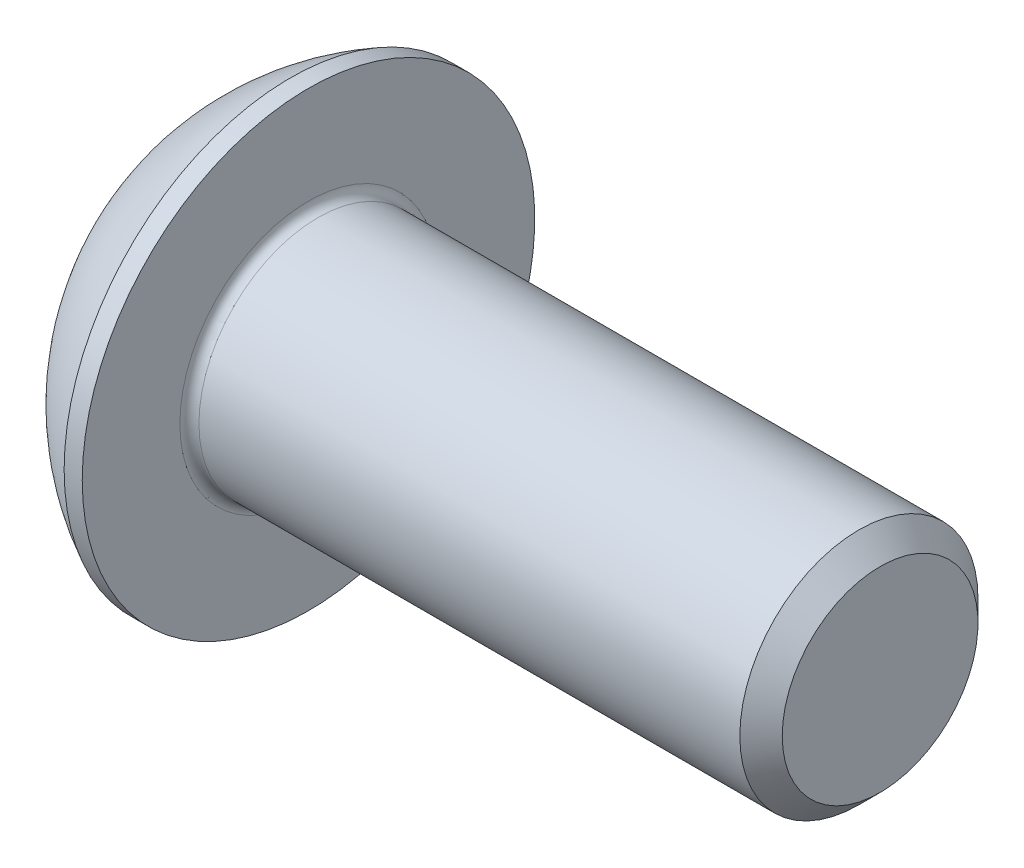
ISO-10303-21;
HEADER;
FILE_DESCRIPTION(('STEP AP214'),'2;1');
FILE_NAME('part.step','',(''),(''),'','','');
FILE_SCHEMA(('AUTOMOTIVE_DESIGN { 1 0 10303 214 1 1 1 1 }'));
ENDSEC;
DATA;
#1=APPLICATION_CONTEXT('core data for automotive mechanical design processes');
#2=APPLICATION_PROTOCOL_DEFINITION('international standard','automotive_design',2000,#1);
#3=PRODUCT_CONTEXT('',#1,'mechanical');
#4=PRODUCT('Part','Part','',(#3));
#5=PRODUCT_RELATED_PRODUCT_CATEGORY('part','',(#4));
#6=PRODUCT_DEFINITION_FORMATION('','',#4);
#7=PRODUCT_DEFINITION_CONTEXT('part definition',#1,'design');
#8=PRODUCT_DEFINITION('design','',#6,#7);
#9=PRODUCT_DEFINITION_SHAPE('','',#8);
#10=(LENGTH_UNIT() NAMED_UNIT(*) SI_UNIT(.MILLI.,.METRE.));
#11=(NAMED_UNIT(*) PLANE_ANGLE_UNIT() SI_UNIT($,.RADIAN.));
#12=(NAMED_UNIT(*) SI_UNIT($,.STERADIAN.) SOLID_ANGLE_UNIT());
#13=UNCERTAINTY_MEASURE_WITH_UNIT(LENGTH_MEASURE(1.E-05),#10,'distance_accuracy_value','');
#14=(GEOMETRIC_REPRESENTATION_CONTEXT(3) GLOBAL_UNCERTAINTY_ASSIGNED_CONTEXT((#13)) GLOBAL_UNIT_ASSIGNED_CONTEXT((#10,
#11,#12)) REPRESENTATION_CONTEXT('',''));
#15=CARTESIAN_POINT('',(0.,0.,0.));
#16=DIRECTION('',(0.,0.,1.));
#17=DIRECTION('',(1.,0.,0.));
#18=AXIS2_PLACEMENT_3D('',#15,#16,#17);
#19=CARTESIAN_POINT('',(0.,0.,0.));
#20=DIRECTION('',(-1.,0.,0.));
#21=DIRECTION('',(0.,0.,1.));
#22=AXIS2_PLACEMENT_3D('',#19,#20,#21);
#23=PLANE('',#22);
#24=CARTESIAN_POINT('',(0.,0.,0.));
#25=DIRECTION('',(-1.,0.,0.));
#26=DIRECTION('',(0.,0.,1.));
#27=AXIS2_PLACEMENT_3D('',#24,#25,#26);
#28=CIRCLE('',#27,2.375);
#29=CARTESIAN_POINT('',(0.,0.,2.375));
#30=VERTEX_POINT('',#29);
#31=EDGE_CURVE('E157',#30,#30,#28,.T.);
#32=ORIENTED_EDGE('',*,*,#31,.T.);
#33=EDGE_LOOP('',(#32));
#34=FACE_BOUND('',#33,.T.);
#35=DIRECTION('',(0.,-1.,0.));
#36=VECTOR('',#35,1.);
#37=CARTESIAN_POINT('',(0.,-0.866025403784438,1.5));
#38=LINE('',#37,#36);
#39=CARTESIAN_POINT('',(0.,0.866025403784439,1.5));
#40=VERTEX_POINT('',#39);
#41=CARTESIAN_POINT('',(0.,-0.866025403784438,1.5));
#42=VERTEX_POINT('',#41);
#43=EDGE_CURVE('E52',#40,#42,#38,.T.);
#44=ORIENTED_EDGE('',*,*,#43,.T.);
#45=DIRECTION('',(0.,-0.500000000000001,-0.866025403784438));
#46=VECTOR('',#45,1.);
#47=CARTESIAN_POINT('',(0.,-1.73205080756888,0.));
#48=LINE('',#47,#46);
#49=CARTESIAN_POINT('',(0.,-1.73205080756888,0.));
#50=VERTEX_POINT('',#49);
#51=EDGE_CURVE('E277',#42,#50,#48,.T.);
#52=ORIENTED_EDGE('',*,*,#51,.T.);
#53=DIRECTION('',(0.,0.500000000000001,-0.866025403784438));
#54=VECTOR('',#53,1.);
#55=CARTESIAN_POINT('',(0.,-0.866025403784438,-1.5));
#56=LINE('',#55,#54);
#57=CARTESIAN_POINT('',(0.,-0.866025403784438,-1.5));
#58=VERTEX_POINT('',#57);
#59=EDGE_CURVE('E132',#50,#58,#56,.T.);
#60=ORIENTED_EDGE('',*,*,#59,.T.);
#61=DIRECTION('',(0.,1.,0.));
#62=VECTOR('',#61,1.);
#63=CARTESIAN_POINT('',(0.,0.866025403784439,-1.5));
#64=LINE('',#63,#62);
#65=CARTESIAN_POINT('',(0.,0.866025403784439,-1.5));
#66=VERTEX_POINT('',#65);
#67=EDGE_CURVE('E280',#58,#66,#64,.T.);
#68=ORIENTED_EDGE('',*,*,#67,.T.);
#69=DIRECTION('',(0.,0.5,0.866025403784439));
#70=VECTOR('',#69,1.);
#71=CARTESIAN_POINT('',(0.,1.73205080756888,0.));
#72=LINE('',#71,#70);
#73=CARTESIAN_POINT('',(0.,1.73205080756888,0.));
#74=VERTEX_POINT('',#73);
#75=EDGE_CURVE('E282',#66,#74,#72,.T.);
#76=ORIENTED_EDGE('',*,*,#75,.T.);
#77=DIRECTION('',(0.,-0.5,0.866025403784439));
#78=VECTOR('',#77,1.);
#79=CARTESIAN_POINT('',(0.,0.866025403784439,1.5));
#80=LINE('',#79,#78);
#81=EDGE_CURVE('E284',#74,#40,#80,.T.);
#82=ORIENTED_EDGE('',*,*,#81,.T.);
#83=EDGE_LOOP('',(#44,#52,#60,#68,#76,#82));
#84=FACE_BOUND('',#83,.T.);
#85=ADVANCED_FACE('F37',(#34,#84),#23,.T.);
#86=CARTESIAN_POINT('',(4.75501582278481,0.,0.));
#87=DIRECTION('',(-1.,0.,0.));
#88=DIRECTION('',(0.,1.,0.));
#89=AXIS2_PLACEMENT_3D('',#86,#87,#88);
#90=SPHERICAL_SURFACE('',#89,5.3151482081814);
#91=CARTESIAN_POINT('',(2.37,0.,0.));
#92=DIRECTION('',(-1.,0.,0.));
#93=DIRECTION('',(0.,0.,1.));
#94=AXIS2_PLACEMENT_3D('',#91,#92,#93);
#95=CIRCLE('',#94,4.75);
#96=CARTESIAN_POINT('',(2.37,0.,4.75));
#97=VERTEX_POINT('',#96);
#98=EDGE_CURVE('E154',#97,#97,#95,.T.);
#99=ORIENTED_EDGE('',*,*,#98,.T.);
#100=EDGE_LOOP('',(#99));
#101=FACE_BOUND('',#100,.T.);
#102=ORIENTED_EDGE('',*,*,#31,.F.);
#103=EDGE_LOOP('',(#102));
#104=FACE_BOUND('',#103,.T.);
#105=ADVANCED_FACE('F178',(#101,#104),#90,.T.);
#106=CARTESIAN_POINT('',(0.,0.,0.));
#107=DIRECTION('',(-1.,0.,0.));
#108=DIRECTION('',(0.,0.,1.));
#109=AXIS2_PLACEMENT_3D('',#106,#107,#108);
#110=CYLINDRICAL_SURFACE('',#109,4.75);
#111=ORIENTED_EDGE('',*,*,#98,.F.);
#112=EDGE_LOOP('',(#111));
#113=FACE_BOUND('',#112,.T.);
#114=CARTESIAN_POINT('',(2.75,0.,0.));
#115=DIRECTION('',(-1.,0.,0.));
#116=DIRECTION('',(0.,0.,1.));
#117=AXIS2_PLACEMENT_3D('',#114,#115,#116);
#118=CIRCLE('',#117,4.75);
#119=CARTESIAN_POINT('',(2.75,0.,4.75));
#120=VERTEX_POINT('',#119);
#121=EDGE_CURVE('E151',#120,#120,#118,.T.);
#122=ORIENTED_EDGE('',*,*,#121,.T.);
#123=EDGE_LOOP('',(#122));
#124=FACE_BOUND('',#123,.T.);
#125=ADVANCED_FACE('F183',(#113,#124),#110,.T.);
#126=CARTESIAN_POINT('',(2.75,2.5,0.));
#127=DIRECTION('',(-1.,0.,0.));
#128=DIRECTION('',(0.,0.,1.));
#129=AXIS2_PLACEMENT_3D('',#126,#127,#128);
#130=PLANE('',#129);
#131=CARTESIAN_POINT('',(2.75,0.,0.));
#132=DIRECTION('',(-1.,0.,0.));
#133=DIRECTION('',(0.,0.,1.));
#134=AXIS2_PLACEMENT_3D('',#131,#132,#133);
#135=CIRCLE('',#134,2.7);
#136=CARTESIAN_POINT('',(2.75,0.,2.7));
#137=VERTEX_POINT('',#136);
#138=EDGE_CURVE('E45',#137,#137,#135,.T.);
#139=ORIENTED_EDGE('',*,*,#138,.T.);
#140=EDGE_LOOP('',(#139));
#141=FACE_BOUND('',#140,.T.);
#142=ORIENTED_EDGE('',*,*,#121,.F.);
#143=EDGE_LOOP('',(#142));
#144=FACE_BOUND('',#143,.T.);
#145=ADVANCED_FACE('F162',(#141,#144),#130,.F.);
#146=CARTESIAN_POINT('',(0.,0.,0.));
#147=DIRECTION('',(-1.,0.,0.));
#148=DIRECTION('',(0.,0.,1.));
#149=AXIS2_PLACEMENT_3D('',#146,#147,#148);
#150=CYLINDRICAL_SURFACE('',#149,2.5);
#151=CARTESIAN_POINT('',(2.95,0.,0.));
#152=DIRECTION('',(-1.,0.,0.));
#153=DIRECTION('',(0.,0.,1.));
#154=AXIS2_PLACEMENT_3D('',#151,#152,#153);
#155=CIRCLE('',#154,2.5);
#156=CARTESIAN_POINT('',(2.95,0.,2.5));
#157=VERTEX_POINT('',#156);
#158=EDGE_CURVE('E11',#157,#157,#155,.F.);
#159=ORIENTED_EDGE('',*,*,#158,.T.);
#160=EDGE_LOOP('',(#159));
#161=FACE_BOUND('',#160,.T.);
#162=CARTESIAN_POINT('',(14.305,0.,0.));
#163=DIRECTION('',(-1.,0.,0.));
#164=DIRECTION('',(0.,0.,1.));
#165=AXIS2_PLACEMENT_3D('',#162,#163,#164);
#166=CIRCLE('',#165,2.5);
#167=CARTESIAN_POINT('',(14.305,0.,2.5));
#168=VERTEX_POINT('',#167);
#169=EDGE_CURVE('E148',#168,#168,#166,.T.);
#170=ORIENTED_EDGE('',*,*,#169,.T.);
#171=EDGE_LOOP('',(#170));
#172=FACE_BOUND('',#171,.T.);
#173=ADVANCED_FACE('F192',(#161,#172),#150,.T.);
#174=CARTESIAN_POINT('',(14.75,0.,0.));
#175=DIRECTION('',(-1.,0.,0.));
#176=DIRECTION('',(0.,0.,1.));
#177=AXIS2_PLACEMENT_3D('',#174,#175,#176);
#178=CONICAL_SURFACE('',#177,2.055,0.785398163397445);
#179=ORIENTED_EDGE('',*,*,#169,.F.);
#180=EDGE_LOOP('',(#179));
#181=FACE_BOUND('',#180,.T.);
#182=CARTESIAN_POINT('',(14.75,0.,0.));
#183=DIRECTION('',(-1.,0.,0.));
#184=DIRECTION('',(0.,0.,1.));
#185=AXIS2_PLACEMENT_3D('',#182,#183,#184);
#186=CIRCLE('',#185,2.055);
#187=CARTESIAN_POINT('',(14.75,0.,2.055));
#188=VERTEX_POINT('',#187);
#189=EDGE_CURVE('E144',#188,#188,#186,.T.);
#190=ORIENTED_EDGE('',*,*,#189,.T.);
#191=EDGE_LOOP('',(#190));
#192=FACE_BOUND('',#191,.T.);
#193=ADVANCED_FACE('F173',(#181,#192),#178,.T.);
#194=CARTESIAN_POINT('',(14.75,0.,0.));
#195=DIRECTION('',(-1.,0.,0.));
#196=DIRECTION('',(0.,0.,1.));
#197=AXIS2_PLACEMENT_3D('',#194,#195,#196);
#198=PLANE('',#197);
#199=ORIENTED_EDGE('',*,*,#189,.F.);
#200=EDGE_LOOP('',(#199));
#201=FACE_BOUND('',#200,.T.);
#202=ADVANCED_FACE('F166',(#201),#198,.F.);
#203=CARTESIAN_POINT('',(2.95,0.,0.));
#204=DIRECTION('',(-1.,0.,0.));
#205=DIRECTION('',(0.,0.,1.));
#206=AXIS2_PLACEMENT_3D('',#203,#204,#205);
#207=TOROIDAL_SURFACE('',#206,2.7,0.2);
#208=ORIENTED_EDGE('',*,*,#158,.F.);
#209=EDGE_LOOP('',(#208));
#210=FACE_BOUND('',#209,.T.);
#211=ORIENTED_EDGE('',*,*,#138,.F.);
#212=EDGE_LOOP('',(#211));
#213=FACE_BOUND('',#212,.T.);
#214=ADVANCED_FACE('F39',(#210,#213),#207,.F.);
#215=CARTESIAN_POINT('',(1.56,-1.73205080756888,0.));
#216=DIRECTION('',(0.,0.866025403784438,-0.500000000000001));
#217=DIRECTION('',(0.,0.500000000000001,0.866025403784438));
#218=AXIS2_PLACEMENT_3D('',#215,#216,#217);
#219=PLANE('',#218);
#220=DIRECTION('',(0.,-0.500000000000001,-0.866025403784438));
#221=VECTOR('',#220,1.);
#222=CARTESIAN_POINT('',(1.56,-1.73205080756888,0.));
#223=LINE('',#222,#221);
#224=CARTESIAN_POINT('',(1.56,-0.866025403784438,1.5));
#225=VERTEX_POINT('',#224);
#226=CARTESIAN_POINT('',(1.56,-1.29903810567666,0.750000000000002));
#227=VERTEX_POINT('',#226);
#228=EDGE_CURVE('E118',#225,#227,#223,.T.);
#229=ORIENTED_EDGE('',*,*,#228,.T.);
#230=CARTESIAN_POINT('',(1.56,-1.73205080756888,0.));
#231=VERTEX_POINT('',#230);
#232=EDGE_CURVE('E113',#227,#231,#223,.T.);
#233=ORIENTED_EDGE('',*,*,#232,.T.);
#234=DIRECTION('',(-1.,0.,0.));
#235=VECTOR('',#234,1.);
#236=CARTESIAN_POINT('',(1.56,-1.73205080756888,0.));
#237=LINE('',#236,#235);
#238=EDGE_CURVE('E115',#231,#50,#237,.T.);
#239=ORIENTED_EDGE('',*,*,#238,.T.);
#240=ORIENTED_EDGE('',*,*,#51,.F.);
#241=DIRECTION('',(-1.,0.,0.));
#242=VECTOR('',#241,1.);
#243=CARTESIAN_POINT('',(1.56,-0.866025403784438,1.5));
#244=LINE('',#243,#242);
#245=EDGE_CURVE('E273',#225,#42,#244,.T.);
#246=ORIENTED_EDGE('',*,*,#245,.F.);
#247=EDGE_LOOP('',(#229,#233,#239,#240,#246));
#248=FACE_BOUND('',#247,.T.);
#249=ADVANCED_FACE('F114',(#248),#219,.T.);
#250=CARTESIAN_POINT('',(1.56,-0.866025403784438,-1.5));
#251=DIRECTION('',(0.,0.866025403784438,0.500000000000001));
#252=DIRECTION('',(0.,-0.500000000000001,0.866025403784438));
#253=AXIS2_PLACEMENT_3D('',#250,#251,#252);
#254=PLANE('',#253);
#255=DIRECTION('',(0.,0.500000000000001,-0.866025403784438));
#256=VECTOR('',#255,1.);
#257=CARTESIAN_POINT('',(1.56,-0.866025403784438,-1.5));
#258=LINE('',#257,#256);
#259=CARTESIAN_POINT('',(1.56,-1.29903810567666,-0.750000000000001));
#260=VERTEX_POINT('',#259);
#261=EDGE_CURVE('E60',#231,#260,#258,.T.);
#262=ORIENTED_EDGE('',*,*,#261,.T.);
#263=CARTESIAN_POINT('',(1.56,-0.866025403784438,-1.5));
#264=VERTEX_POINT('',#263);
#265=EDGE_CURVE('E127',#260,#264,#258,.T.);
#266=ORIENTED_EDGE('',*,*,#265,.T.);
#267=DIRECTION('',(-1.,0.,0.));
#268=VECTOR('',#267,1.);
#269=CARTESIAN_POINT('',(1.56,-0.866025403784438,-1.5));
#270=LINE('',#269,#268);
#271=EDGE_CURVE('E134',#264,#58,#270,.T.);
#272=ORIENTED_EDGE('',*,*,#271,.T.);
#273=ORIENTED_EDGE('',*,*,#59,.F.);
#274=ORIENTED_EDGE('',*,*,#238,.F.);
#275=EDGE_LOOP('',(#262,#266,#272,#273,#274));
#276=FACE_BOUND('',#275,.T.);
#277=ADVANCED_FACE('F130',(#276),#254,.T.);
#278=CARTESIAN_POINT('',(1.56,0.866025403784439,-1.5));
#279=DIRECTION('',(0.,0.,1.));
#280=DIRECTION('',(1.,0.,0.));
#281=AXIS2_PLACEMENT_3D('',#278,#279,#280);
#282=PLANE('',#281);
#283=DIRECTION('',(0.,1.,0.));
#284=VECTOR('',#283,1.);
#285=CARTESIAN_POINT('',(1.56,0.866025403784439,-1.5));
#286=LINE('',#285,#284);
#287=CARTESIAN_POINT('',(1.56,0.,-1.5));
#288=VERTEX_POINT('',#287);
#289=EDGE_CURVE('E254',#264,#288,#286,.T.);
#290=ORIENTED_EDGE('',*,*,#289,.T.);
#291=CARTESIAN_POINT('',(1.56,0.866025403784439,-1.5));
#292=VERTEX_POINT('',#291);
#293=EDGE_CURVE('E126',#288,#292,#286,.T.);
#294=ORIENTED_EDGE('',*,*,#293,.T.);
#295=DIRECTION('',(-1.,0.,0.));
#296=VECTOR('',#295,1.);
#297=CARTESIAN_POINT('',(1.56,0.866025403784439,-1.5));
#298=LINE('',#297,#296);
#299=EDGE_CURVE('E139',#292,#66,#298,.T.);
#300=ORIENTED_EDGE('',*,*,#299,.T.);
#301=ORIENTED_EDGE('',*,*,#67,.F.);
#302=ORIENTED_EDGE('',*,*,#271,.F.);
#303=EDGE_LOOP('',(#290,#294,#300,#301,#302));
#304=FACE_BOUND('',#303,.T.);
#305=ADVANCED_FACE('F206',(#304),#282,.T.);
#306=CARTESIAN_POINT('',(1.56,1.73205080756888,0.));
#307=DIRECTION('',(0.,-0.866025403784439,0.5));
#308=DIRECTION('',(0.,-0.5,-0.866025403784439));
#309=AXIS2_PLACEMENT_3D('',#306,#307,#308);
#310=PLANE('',#309);
#311=DIRECTION('',(0.,0.5,0.866025403784439));
#312=VECTOR('',#311,1.);
#313=CARTESIAN_POINT('',(1.56,1.73205080756888,0.));
#314=LINE('',#313,#312);
#315=CARTESIAN_POINT('',(1.56,1.29903810567666,-0.75));
#316=VERTEX_POINT('',#315);
#317=EDGE_CURVE('E243',#292,#316,#314,.T.);
#318=ORIENTED_EDGE('',*,*,#317,.T.);
#319=CARTESIAN_POINT('',(1.56,1.73205080756888,0.));
#320=VERTEX_POINT('',#319);
#321=EDGE_CURVE('E248',#316,#320,#314,.T.);
#322=ORIENTED_EDGE('',*,*,#321,.T.);
#323=DIRECTION('',(-1.,0.,0.));
#324=VECTOR('',#323,1.);
#325=CARTESIAN_POINT('',(1.56,1.73205080756888,0.));
#326=LINE('',#325,#324);
#327=EDGE_CURVE('E288',#320,#74,#326,.T.);
#328=ORIENTED_EDGE('',*,*,#327,.T.);
#329=ORIENTED_EDGE('',*,*,#75,.F.);
#330=ORIENTED_EDGE('',*,*,#299,.F.);
#331=EDGE_LOOP('',(#318,#322,#328,#329,#330));
#332=FACE_BOUND('',#331,.T.);
#333=ADVANCED_FACE('F209',(#332),#310,.T.);
#334=CARTESIAN_POINT('',(1.56,0.866025403784439,1.5));
#335=DIRECTION('',(0.,-0.866025403784439,-0.5));
#336=DIRECTION('',(0.,0.5,-0.866025403784439));
#337=AXIS2_PLACEMENT_3D('',#334,#335,#336);
#338=PLANE('',#337);
#339=DIRECTION('',(0.,-0.5,0.866025403784439));
#340=VECTOR('',#339,1.);
#341=CARTESIAN_POINT('',(1.56,0.866025403784439,1.5));
#342=LINE('',#341,#340);
#343=CARTESIAN_POINT('',(1.56,1.29903810567666,0.75));
#344=VERTEX_POINT('',#343);
#345=EDGE_CURVE('E251',#320,#344,#342,.T.);
#346=ORIENTED_EDGE('',*,*,#345,.T.);
#347=CARTESIAN_POINT('',(1.56,0.866025403784439,1.5));
#348=VERTEX_POINT('',#347);
#349=EDGE_CURVE('E259',#344,#348,#342,.T.);
#350=ORIENTED_EDGE('',*,*,#349,.T.);
#351=DIRECTION('',(-1.,0.,0.));
#352=VECTOR('',#351,1.);
#353=CARTESIAN_POINT('',(1.56,0.866025403784439,1.5));
#354=LINE('',#353,#352);
#355=EDGE_CURVE('E272',#348,#40,#354,.T.);
#356=ORIENTED_EDGE('',*,*,#355,.T.);
#357=ORIENTED_EDGE('',*,*,#81,.F.);
#358=ORIENTED_EDGE('',*,*,#327,.F.);
#359=EDGE_LOOP('',(#346,#350,#356,#357,#358));
#360=FACE_BOUND('',#359,.T.);
#361=ADVANCED_FACE('F213',(#360),#338,.T.);
#362=CARTESIAN_POINT('',(1.56,-0.866025403784438,1.5));
#363=DIRECTION('',(0.,0.,-1.));
#364=DIRECTION('',(-1.,0.,0.));
#365=AXIS2_PLACEMENT_3D('',#362,#363,#364);
#366=PLANE('',#365);
#367=DIRECTION('',(0.,-1.,0.));
#368=VECTOR('',#367,1.);
#369=CARTESIAN_POINT('',(1.56,-0.866025403784438,1.5));
#370=LINE('',#369,#368);
#371=CARTESIAN_POINT('',(1.56,0.,1.5));
#372=VERTEX_POINT('',#371);
#373=EDGE_CURVE('E265',#348,#372,#370,.T.);
#374=ORIENTED_EDGE('',*,*,#373,.T.);
#375=EDGE_CURVE('E267',#372,#225,#370,.T.);
#376=ORIENTED_EDGE('',*,*,#375,.T.);
#377=ORIENTED_EDGE('',*,*,#245,.T.);
#378=ORIENTED_EDGE('',*,*,#43,.F.);
#379=ORIENTED_EDGE('',*,*,#355,.F.);
#380=EDGE_LOOP('',(#374,#376,#377,#378,#379));
#381=FACE_BOUND('',#380,.T.);
#382=ADVANCED_FACE('F217',(#381),#366,.T.);
#383=CARTESIAN_POINT('',(1.56,-1.73205080756888,0.));
#384=DIRECTION('',(1.,0.,0.));
#385=DIRECTION('',(0.,0.,-1.));
#386=AXIS2_PLACEMENT_3D('',#383,#384,#385);
#387=PLANE('',#386);
#388=CARTESIAN_POINT('',(1.56,0.,0.));
#389=DIRECTION('',(-1.,0.,0.));
#390=DIRECTION('',(0.,0.,1.));
#391=AXIS2_PLACEMENT_3D('',#388,#389,#390);
#392=CIRCLE('',#391,1.5);
#393=EDGE_CURVE('E240',#316,#288,#392,.T.);
#394=ORIENTED_EDGE('',*,*,#393,.F.);
#395=ORIENTED_EDGE('',*,*,#317,.F.);
#396=ORIENTED_EDGE('',*,*,#293,.F.);
#397=EDGE_LOOP('',(#394,#395,#396));
#398=FACE_BOUND('',#397,.T.);
#399=ADVANCED_FACE('F221',(#398),#387,.F.);
#400=EDGE_CURVE('E145',#344,#316,#392,.T.);
#401=ORIENTED_EDGE('',*,*,#400,.F.);
#402=ORIENTED_EDGE('',*,*,#345,.F.);
#403=ORIENTED_EDGE('',*,*,#321,.F.);
#404=EDGE_LOOP('',(#401,#402,#403));
#405=FACE_BOUND('',#404,.T.);
#406=ADVANCED_FACE('F230',(#405),#387,.F.);
#407=EDGE_CURVE('E138',#372,#344,#392,.T.);
#408=ORIENTED_EDGE('',*,*,#407,.F.);
#409=ORIENTED_EDGE('',*,*,#373,.F.);
#410=ORIENTED_EDGE('',*,*,#349,.F.);
#411=EDGE_LOOP('',(#408,#409,#410));
#412=FACE_BOUND('',#411,.T.);
#413=ADVANCED_FACE('F235',(#412),#387,.F.);
#414=EDGE_CURVE('E133',#227,#372,#392,.T.);
#415=ORIENTED_EDGE('',*,*,#414,.F.);
#416=ORIENTED_EDGE('',*,*,#228,.F.);
#417=ORIENTED_EDGE('',*,*,#375,.F.);
#418=EDGE_LOOP('',(#415,#416,#417));
#419=FACE_BOUND('',#418,.T.);
#420=ADVANCED_FACE('F228',(#419),#387,.F.);
#421=EDGE_CURVE('E124',#260,#227,#392,.T.);
#422=ORIENTED_EDGE('',*,*,#421,.F.);
#423=ORIENTED_EDGE('',*,*,#261,.F.);
#424=ORIENTED_EDGE('',*,*,#232,.F.);
#425=EDGE_LOOP('',(#422,#423,#424));
#426=FACE_BOUND('',#425,.T.);
#427=ADVANCED_FACE('F123',(#426),#387,.F.);
#428=EDGE_CURVE('E246',#288,#260,#392,.T.);
#429=ORIENTED_EDGE('',*,*,#428,.F.);
#430=ORIENTED_EDGE('',*,*,#289,.F.);
#431=ORIENTED_EDGE('',*,*,#265,.F.);
#432=EDGE_LOOP('',(#429,#430,#431));
#433=FACE_BOUND('',#432,.T.);
#434=ADVANCED_FACE('F201',(#433),#387,.F.);
#435=CARTESIAN_POINT('',(2.42602540378445,0.,0.));
#436=DIRECTION('',(-1.,0.,0.));
#437=DIRECTION('',(0.,0.,1.));
#438=AXIS2_PLACEMENT_3D('',#435,#436,#437);
#439=CONICAL_SURFACE('',#438,0.,1.04719755119659);
#440=ORIENTED_EDGE('',*,*,#407,.T.);
#441=ORIENTED_EDGE('',*,*,#400,.T.);
#442=ORIENTED_EDGE('',*,*,#393,.T.);
#443=ORIENTED_EDGE('',*,*,#428,.T.);
#444=ORIENTED_EDGE('',*,*,#421,.T.);
#445=ORIENTED_EDGE('',*,*,#414,.T.);
#446=EDGE_LOOP('',(#440,#441,#442,#443,#444,#445));
#447=FACE_BOUND('',#446,.T.);
#448=CARTESIAN_POINT('',(2.42602540378445,0.,0.));
#449=VERTEX_POINT('',#448);
#450=VERTEX_LOOP('',#449);
#451=FACE_BOUND('',#450,.T.);
#452=ADVANCED_FACE('F199',(#447,#451),#439,.F.);
#453=CLOSED_SHELL('',(#85,#105,#125,#145,#173,#193,#202,#214,#249,#277,#305,#333,#361,#382,#399,
#406,#413,#420,#427,#434,#452));
#454=MANIFOLD_SOLID_BREP('B2',#453);
#455=ADVANCED_BREP_SHAPE_REPRESENTATION('',(#18,#454),#14);
#456=SHAPE_DEFINITION_REPRESENTATION(#9,#455);
ENDSEC;
END-ISO-10303-21;
